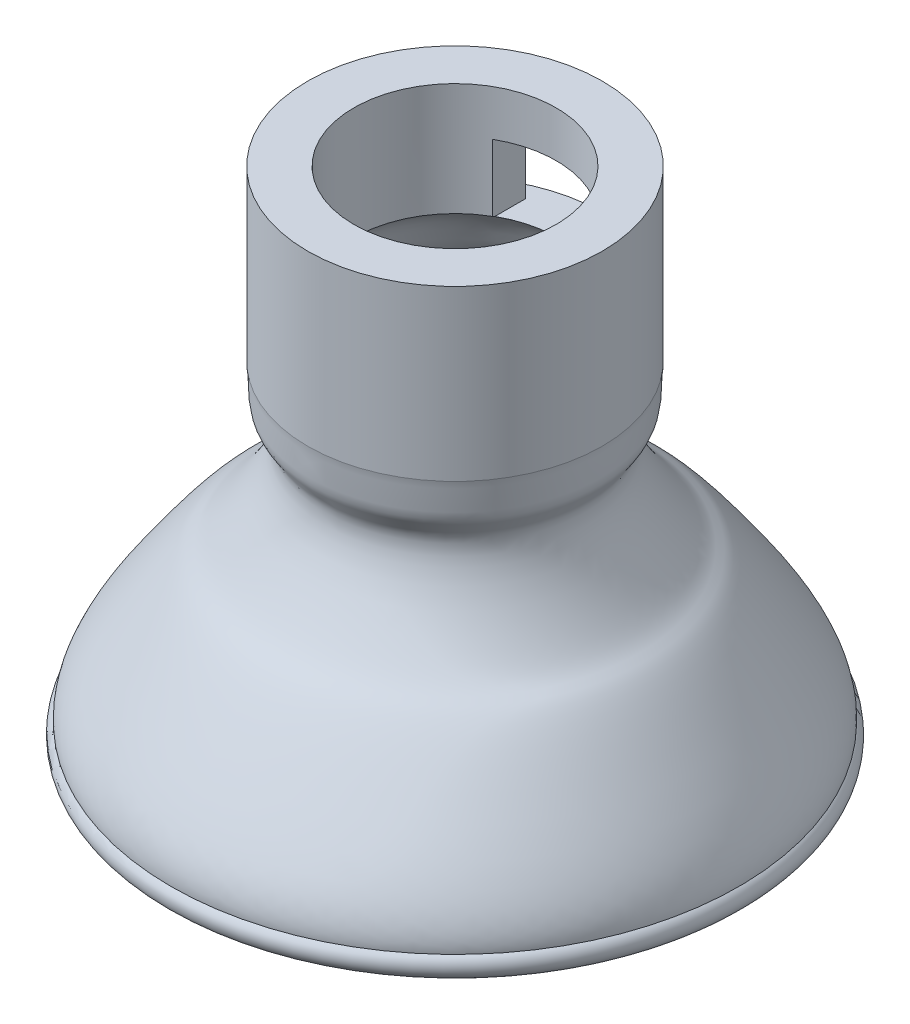
ISO-10303-21;
HEADER;
FILE_DESCRIPTION(('STEP AP214'),'2;1');
FILE_NAME('part.step','',(''),(''),'','','');
FILE_SCHEMA(('AUTOMOTIVE_DESIGN { 1 0 10303 214 1 1 1 1 }'));
ENDSEC;
DATA;
#1=APPLICATION_CONTEXT('core data for automotive mechanical design processes');
#2=APPLICATION_PROTOCOL_DEFINITION('international standard','automotive_design',2000,#1);
#3=PRODUCT_CONTEXT('',#1,'mechanical');
#4=PRODUCT('Part','Part','',(#3));
#5=PRODUCT_RELATED_PRODUCT_CATEGORY('part','',(#4));
#6=PRODUCT_DEFINITION_FORMATION('','',#4);
#7=PRODUCT_DEFINITION_CONTEXT('part definition',#1,'design');
#8=PRODUCT_DEFINITION('design','',#6,#7);
#9=PRODUCT_DEFINITION_SHAPE('','',#8);
#10=(LENGTH_UNIT() NAMED_UNIT(*) SI_UNIT(.MILLI.,.METRE.));
#11=(NAMED_UNIT(*) PLANE_ANGLE_UNIT() SI_UNIT($,.RADIAN.));
#12=(NAMED_UNIT(*) SI_UNIT($,.STERADIAN.) SOLID_ANGLE_UNIT());
#13=UNCERTAINTY_MEASURE_WITH_UNIT(LENGTH_MEASURE(1.E-05),#10,'distance_accuracy_value','');
#14=(GEOMETRIC_REPRESENTATION_CONTEXT(3) GLOBAL_UNCERTAINTY_ASSIGNED_CONTEXT((#13)) GLOBAL_UNIT_ASSIGNED_CONTEXT((#10,
#11,#12)) REPRESENTATION_CONTEXT('',''));
#15=CARTESIAN_POINT('',(0.,0.,0.));
#16=DIRECTION('',(0.,0.,1.));
#17=DIRECTION('',(1.,0.,0.));
#18=AXIS2_PLACEMENT_3D('',#15,#16,#17);
#19=CARTESIAN_POINT('',(0.,44.5173718932186,0.));
#20=DIRECTION('',(0.,1.,0.));
#21=DIRECTION('',(0.,0.,1.));
#22=AXIS2_PLACEMENT_3D('',#19,#20,#21);
#23=CYLINDRICAL_SURFACE('',#22,12.4935963391292);
#24=CARTESIAN_POINT('',(0.,55.7803856774506,0.));
#25=DIRECTION('',(0.,1.,0.));
#26=DIRECTION('',(0.,0.,1.));
#27=AXIS2_PLACEMENT_3D('',#24,#25,#26);
#28=CIRCLE('',#27,12.4935963391292);
#29=CARTESIAN_POINT('',(0.,55.7803856774506,12.4935963391292));
#30=VERTEX_POINT('',#29);
#31=EDGE_CURVE('E203',#30,#30,#28,.T.);
#32=ORIENTED_EDGE('',*,*,#31,.F.);
#33=EDGE_LOOP('',(#32));
#34=FACE_BOUND('',#33,.T.);
#35=CARTESIAN_POINT('',(0.,41.4598835914558,0.));
#36=DIRECTION('',(0.,1.,0.));
#37=DIRECTION('',(0.,0.,1.));
#38=AXIS2_PLACEMENT_3D('',#35,#36,#37);
#39=CIRCLE('',#38,12.4935963391292);
#40=CARTESIAN_POINT('',(0.,41.4598835914558,12.4935963391292));
#41=VERTEX_POINT('',#40);
#42=EDGE_CURVE('E204',#41,#41,#39,.T.);
#43=ORIENTED_EDGE('',*,*,#42,.T.);
#44=EDGE_LOOP('',(#43));
#45=FACE_BOUND('',#44,.T.);
#46=DIRECTION('',(0.,1.,0.));
#47=VECTOR('',#46,1.);
#48=CARTESIAN_POINT('',(7.14365701002743,44.5173718932186,-10.2497860469469));
#49=LINE('',#48,#47);
#50=CARTESIAN_POINT('',(7.14365701002743,51.8993350708418,-10.2497860469469));
#51=VERTEX_POINT('',#50);
#52=CARTESIAN_POINT('',(7.14365701002743,46.1352918868515,-10.2497860469469));
#53=VERTEX_POINT('',#52);
#54=EDGE_CURVE('E94',#51,#53,#49,.F.);
#55=ORIENTED_EDGE('',*,*,#54,.F.);
#56=CARTESIAN_POINT('',(0.,51.8993350708418,0.));
#57=DIRECTION('',(0.,1.,0.));
#58=DIRECTION('',(0.,0.,1.));
#59=AXIS2_PLACEMENT_3D('',#56,#57,#58);
#60=CIRCLE('',#59,12.4935963391292);
#61=CARTESIAN_POINT('',(-7.14365701002743,51.8993350708418,-10.2497860469469));
#62=VERTEX_POINT('',#61);
#63=EDGE_CURVE('E131',#51,#62,#60,.T.);
#64=ORIENTED_EDGE('',*,*,#63,.T.);
#65=DIRECTION('',(0.,1.,0.));
#66=VECTOR('',#65,1.);
#67=CARTESIAN_POINT('',(-7.14365701002743,44.5173718932186,-10.2497860469469));
#68=LINE('',#67,#66);
#69=CARTESIAN_POINT('',(-7.14365701002743,46.1352918868515,-10.2497860469469));
#70=VERTEX_POINT('',#69);
#71=EDGE_CURVE('E96',#70,#62,#68,.T.);
#72=ORIENTED_EDGE('',*,*,#71,.F.);
#73=CARTESIAN_POINT('',(0.,46.1352918868515,0.));
#74=DIRECTION('',(0.,-1.,0.));
#75=DIRECTION('',(0.,0.,-1.));
#76=AXIS2_PLACEMENT_3D('',#73,#74,#75);
#77=CIRCLE('',#76,12.4935963391292);
#78=EDGE_CURVE('E42',#70,#53,#77,.T.);
#79=ORIENTED_EDGE('',*,*,#78,.T.);
#80=EDGE_LOOP('',(#55,#64,#72,#79));
#81=FACE_BOUND('',#80,.T.);
#82=ADVANCED_FACE('F32',(#34,#45,#81),#23,.T.);
#83=CARTESIAN_POINT('',(-4.26037974468844,46.1352918868515,-21.));
#84=DIRECTION('',(-1.,0.,0.));
#85=DIRECTION('',(0.,0.,1.));
#86=AXIS2_PLACEMENT_3D('',#83,#84,#85);
#87=PLANE('',#86);
#88=DIRECTION('',(0.,-1.,0.));
#89=VECTOR('',#88,1.);
#90=CARTESIAN_POINT('',(-4.26037974468844,46.1352918868515,-10.2497860469469));
#91=LINE('',#90,#89);
#92=CARTESIAN_POINT('',(-4.26037974468844,51.8993350708418,-10.2497860469469));
#93=VERTEX_POINT('',#92);
#94=CARTESIAN_POINT('',(-4.26037974468844,46.1352918868515,-10.2497860469469));
#95=VERTEX_POINT('',#94);
#96=EDGE_CURVE('E106',#93,#95,#91,.T.);
#97=ORIENTED_EDGE('',*,*,#96,.F.);
#98=DIRECTION('',(0.,0.,1.));
#99=VECTOR('',#98,1.);
#100=CARTESIAN_POINT('',(-4.26037974468844,51.8993350708418,-21.));
#101=LINE('',#100,#99);
#102=CARTESIAN_POINT('',(-4.26037974468844,51.8993350708418,-7.44282760856129));
#103=VERTEX_POINT('',#102);
#104=EDGE_CURVE('E120',#93,#103,#101,.T.);
#105=ORIENTED_EDGE('',*,*,#104,.T.);
#106=DIRECTION('',(0.,1.,0.));
#107=VECTOR('',#106,1.);
#108=CARTESIAN_POINT('',(-4.26037974468844,44.5173718932186,-7.44282760856129));
#109=LINE('',#108,#107);
#110=CARTESIAN_POINT('',(-4.26037974468844,46.2369670314063,-7.44282760856129));
#111=VERTEX_POINT('',#110);
#112=EDGE_CURVE('E98',#111,#103,#109,.T.);
#113=ORIENTED_EDGE('',*,*,#112,.F.);
#114=CARTESIAN_POINT('',(-4.26037974468844,46.1352918868515,-7.64548123228192));
#115=CARTESIAN_POINT('',(-4.26037974468844,46.1532267587351,-7.61220183553225));
#116=CARTESIAN_POINT('',(-4.26037974468844,46.1706671233898,-7.5786743351807));
#117=CARTESIAN_POINT('',(-4.26037974468844,46.2045588382414,-7.51112312727382));
#118=CARTESIAN_POINT('',(-4.26037974468844,46.2210101884383,-7.4770994197185));
#119=CARTESIAN_POINT('',(-4.26037974468844,46.2369670314063,-7.44282760856129));
#120=B_SPLINE_CURVE_WITH_KNOTS('',3,(#114,#115,#116,#117,#118,#119),.UNSPECIFIED.,.F.,.F.,(4,2,
4),(0.,0.113376965879346,0.226753931758696),.UNSPECIFIED.);
#121=CARTESIAN_POINT('',(-4.26037974468844,46.1352918868516,-7.64548123228194));
#122=VERTEX_POINT('',#121);
#123=EDGE_CURVE('E149',#122,#111,#120,.T.);
#124=ORIENTED_EDGE('',*,*,#123,.F.);
#125=DIRECTION('',(0.,0.,1.));
#126=VECTOR('',#125,1.);
#127=CARTESIAN_POINT('',(-4.26037974468844,46.1352918868515,-21.));
#128=LINE('',#127,#126);
#129=EDGE_CURVE('E119',#95,#122,#128,.T.);
#130=ORIENTED_EDGE('',*,*,#129,.F.);
#131=EDGE_LOOP('',(#97,#105,#113,#124,#130));
#132=FACE_BOUND('',#131,.T.);
#133=ADVANCED_FACE('F138',(#132),#87,.F.);
#134=CARTESIAN_POINT('',(4.26037974468844,46.1352918868515,-21.));
#135=DIRECTION('',(1.,0.,0.));
#136=DIRECTION('',(0.,0.,-1.));
#137=AXIS2_PLACEMENT_3D('',#134,#135,#136);
#138=PLANE('',#137);
#139=DIRECTION('',(0.,1.,0.));
#140=VECTOR('',#139,1.);
#141=CARTESIAN_POINT('',(4.26037974468844,46.1352918868515,-10.2497860469469));
#142=LINE('',#141,#140);
#143=CARTESIAN_POINT('',(4.26037974468844,46.1352918868515,-10.2497860469469));
#144=VERTEX_POINT('',#143);
#145=CARTESIAN_POINT('',(4.26037974468844,51.8993350708418,-10.2497860469469));
#146=VERTEX_POINT('',#145);
#147=EDGE_CURVE('E11',#144,#146,#142,.T.);
#148=ORIENTED_EDGE('',*,*,#147,.F.);
#149=DIRECTION('',(0.,0.,1.));
#150=VECTOR('',#149,1.);
#151=CARTESIAN_POINT('',(4.26037974468844,46.1352918868515,-21.));
#152=LINE('',#151,#150);
#153=CARTESIAN_POINT('',(4.26037974468844,46.1352918868516,-7.64548123228194));
#154=VERTEX_POINT('',#153);
#155=EDGE_CURVE('E111',#144,#154,#152,.T.);
#156=ORIENTED_EDGE('',*,*,#155,.T.);
#157=CARTESIAN_POINT('',(4.26037974468844,46.2369670314063,-7.44282760856129));
#158=CARTESIAN_POINT('',(4.26037974468844,46.2210101884382,-7.47709941971862));
#159=CARTESIAN_POINT('',(4.26037974468844,46.2045588382413,-7.51112312727406));
#160=CARTESIAN_POINT('',(4.26037974468844,46.1706671233895,-7.57867433518117));
#161=CARTESIAN_POINT('',(4.26037974468844,46.1532267587348,-7.61220183553284));
#162=CARTESIAN_POINT('',(4.26037974468844,46.1352918868512,-7.64548123228262));
#163=B_SPLINE_CURVE_WITH_KNOTS('',3,(#157,#158,#159,#160,#161,#162),.UNSPECIFIED.,.F.,.F.,(4,2,
4),(0.,0.113376965879743,0.226753931759487),.UNSPECIFIED.);
#164=CARTESIAN_POINT('',(4.26037974468844,46.2369670314063,-7.44282760856129));
#165=VERTEX_POINT('',#164);
#166=EDGE_CURVE('E57',#165,#154,#163,.T.);
#167=ORIENTED_EDGE('',*,*,#166,.F.);
#168=DIRECTION('',(0.,1.,0.));
#169=VECTOR('',#168,1.);
#170=CARTESIAN_POINT('',(4.26037974468844,44.5173718932186,-7.44282760856129));
#171=LINE('',#170,#169);
#172=CARTESIAN_POINT('',(4.26037974468844,51.8993350708418,-7.44282760856129));
#173=VERTEX_POINT('',#172);
#174=EDGE_CURVE('E219',#173,#165,#171,.F.);
#175=ORIENTED_EDGE('',*,*,#174,.F.);
#176=DIRECTION('',(0.,0.,1.));
#177=VECTOR('',#176,1.);
#178=CARTESIAN_POINT('',(4.26037974468844,51.8993350708418,-21.));
#179=LINE('',#178,#177);
#180=EDGE_CURVE('E122',#146,#173,#179,.T.);
#181=ORIENTED_EDGE('',*,*,#180,.F.);
#182=EDGE_LOOP('',(#148,#156,#167,#175,#181));
#183=FACE_BOUND('',#182,.T.);
#184=ADVANCED_FACE('F133',(#183),#138,.F.);
#185=CARTESIAN_POINT('',(8.5759266776083,46.2369670314063,0.));
#186=CARTESIAN_POINT('',(10.332192588142,45.2940319100021,0.));
#187=CARTESIAN_POINT('',(10.4933290377803,43.239681156603,0.));
#188=CARTESIAN_POINT('',(11.3073060680917,41.6407575609535,0.));
#189=B_SPLINE_CURVE_WITH_KNOTS('',3,(#185,#186,#187,#188),.UNSPECIFIED.,.F.,.F.,(4,4),(0.,1.),.UNSPECIFIED.);
#190=CARTESIAN_POINT('',(0.,44.5173718932186,0.));
#191=DIRECTION('',(0.,1.,0.));
#192=AXIS1_PLACEMENT('',#190,#191);
#193=SURFACE_OF_REVOLUTION('',#189,#192);
#194=CARTESIAN_POINT('',(0.,41.6407575609535,0.));
#195=DIRECTION('',(0.,1.,0.));
#196=DIRECTION('',(0.,0.,1.));
#197=AXIS2_PLACEMENT_3D('',#194,#195,#196);
#198=CIRCLE('',#197,11.3073060680917);
#199=CARTESIAN_POINT('',(0.,41.6407575609535,11.3073060680917));
#200=VERTEX_POINT('',#199);
#201=EDGE_CURVE('E216',#200,#200,#198,.T.);
#202=ORIENTED_EDGE('',*,*,#201,.F.);
#203=EDGE_LOOP('',(#202));
#204=FACE_BOUND('',#203,.T.);
#205=CARTESIAN_POINT('',(0.,46.1352918868516,0.));
#206=DIRECTION('',(0.,1.,0.));
#207=DIRECTION('',(0.,0.,1.));
#208=AXIS2_PLACEMENT_3D('',#205,#206,#207);
#209=CIRCLE('',#208,8.75238360917338);
#210=EDGE_CURVE('E155',#154,#122,#209,.T.);
#211=ORIENTED_EDGE('',*,*,#210,.T.);
#212=ORIENTED_EDGE('',*,*,#123,.T.);
#213=CARTESIAN_POINT('',(0.,46.2369670314063,0.));
#214=DIRECTION('',(0.,1.,0.));
#215=DIRECTION('',(0.,0.,1.));
#216=AXIS2_PLACEMENT_3D('',#213,#214,#215);
#217=CIRCLE('',#216,8.5759266776083);
#218=EDGE_CURVE('E157',#111,#165,#217,.T.);
#219=ORIENTED_EDGE('',*,*,#218,.T.);
#220=ORIENTED_EDGE('',*,*,#166,.T.);
#221=EDGE_LOOP('',(#211,#212,#219,#220));
#222=FACE_BOUND('',#221,.T.);
#223=ADVANCED_FACE('F34',(#204,#222),#193,.T.);
#224=CARTESIAN_POINT('',(11.3073060680917,41.6407575609535,0.));
#225=CARTESIAN_POINT('',(11.273508041599,41.4190879082118,0.));
#226=CARTESIAN_POINT('',(11.2251015035486,40.9573761069875,0.));
#227=CARTESIAN_POINT('',(11.1930262788754,40.1522096645191,0.));
#228=CARTESIAN_POINT('',(11.1940251636809,39.3040884747996,0.));
#229=CARTESIAN_POINT('',(11.1105742964061,38.7770787074592,0.));
#230=CARTESIAN_POINT('',(11.0298099911624,38.5851130778379,0.));
#231=CARTESIAN_POINT('',(10.8756263455903,38.3306613844222,0.));
#232=CARTESIAN_POINT('',(10.6327827141087,37.9932061061229,0.));
#233=CARTESIAN_POINT('',(10.3378807728369,37.5542407148791,0.));
#234=CARTESIAN_POINT('',(10.0435892672873,36.9656870997583,0.));
#235=CARTESIAN_POINT('',(9.82602737150881,36.0076366987024,0.));
#236=CARTESIAN_POINT('',(9.9145565741438,34.8903359516371,0.));
#237=CARTESIAN_POINT('',(10.2964891531475,33.5752929992727,0.));
#238=CARTESIAN_POINT('',(10.8638919097121,32.2936180990521,0.));
#239=CARTESIAN_POINT('',(11.7590713878996,30.6644683747912,0.));
#240=CARTESIAN_POINT('',(12.9463673409138,28.9199205511686,0.));
#241=CARTESIAN_POINT('',(13.9488027624371,27.6965326702799,0.));
#242=CARTESIAN_POINT('',(14.8014094043892,26.960382806733,0.));
#243=CARTESIAN_POINT('',(15.4186672927998,26.5770592305342,0.));
#244=CARTESIAN_POINT('',(15.8418449649625,26.2557480792935,0.));
#245=CARTESIAN_POINT('',(16.5895523927449,25.4893297297657,0.));
#246=CARTESIAN_POINT('',(17.6296319300326,24.2205109793635,0.));
#247=CARTESIAN_POINT('',(19.0007275572404,22.3695444808766,0.));
#248=CARTESIAN_POINT('',(20.5443708517538,20.2007844705444,0.));
#249=CARTESIAN_POINT('',(21.7129288063574,18.3358963729081,0.));
#250=CARTESIAN_POINT('',(22.30297555417,17.206719636529,0.));
#251=CARTESIAN_POINT('',(22.6378524988566,16.3822789589346,0.));
#252=CARTESIAN_POINT('',(22.8087304327176,15.8291983435413,0.));
#253=CARTESIAN_POINT('',(22.8907692851184,15.3467573554972,0.));
#254=CARTESIAN_POINT('',(22.8942843663275,15.1404230191427,0.));
#255=CARTESIAN_POINT('',(22.8835923643521,15.0235539243176,0.));
#256=B_SPLINE_CURVE_WITH_KNOTS('',3,(#224,#225,#226,#227,#228,#229,#230,#231,#232,#233,#234,
#235,#236,#237,#238,#239,#240,#241,#242,#243,#244,#245,#246,#247,#248,#249,#250,#251,#252,#253,
#254,#255),.UNSPECIFIED.,.F.,.F.,(4,1,1,1,1,1,1,1,1,1,1,1,1,1,1,1,1,1,1,1,1,1,1,1,1,1,1,1,1,4),
(0.,0.015625,0.03125,0.0625,0.09375,0.109375,0.125,0.140625,0.15625,0.171875,0.1875,0.21875,
0.25,0.28125,0.3125,0.375,0.4375,0.5,0.5625,0.625,0.6875,0.75,0.8125,0.875,0.90625,0.9375,
0.953125,0.96875,0.984375,1.),.UNSPECIFIED.);
#257=CARTESIAN_POINT('',(0.,44.5173718932186,0.));
#258=DIRECTION('',(0.,1.,0.));
#259=AXIS1_PLACEMENT('',#257,#258);
#260=SURFACE_OF_REVOLUTION('',#256,#259);
#261=CARTESIAN_POINT('',(0.,15.0235539243176,0.));
#262=DIRECTION('',(0.,1.,0.));
#263=DIRECTION('',(0.,0.,1.));
#264=AXIS2_PLACEMENT_3D('',#261,#262,#263);
#265=CIRCLE('',#264,22.8835923643521);
#266=CARTESIAN_POINT('',(0.,15.0235539243176,22.8835923643521));
#267=VERTEX_POINT('',#266);
#268=EDGE_CURVE('E213',#267,#267,#265,.T.);
#269=ORIENTED_EDGE('',*,*,#268,.F.);
#270=EDGE_LOOP('',(#269));
#271=FACE_BOUND('',#270,.T.);
#272=ORIENTED_EDGE('',*,*,#201,.T.);
#273=EDGE_LOOP('',(#272));
#274=FACE_BOUND('',#273,.T.);
#275=ADVANCED_FACE('F176',(#271,#274),#260,.T.);
#276=CARTESIAN_POINT('',(0.,14.0472447319222,0.));
#277=DIRECTION('',(0.,1.,0.));
#278=DIRECTION('',(0.,0.,1.));
#279=AXIS2_PLACEMENT_3D('',#276,#277,#278);
#280=TOROIDAL_SURFACE('',#279,23.3967785015059,1.10296856279885);
#281=CARTESIAN_POINT('',(0.,14.9142261099905,0.));
#282=DIRECTION('',(0.,1.,0.));
#283=DIRECTION('',(0.,0.,1.));
#284=AXIS2_PLACEMENT_3D('',#281,#282,#283);
#285=CIRCLE('',#284,24.0786017488401);
#286=CARTESIAN_POINT('',(0.,14.9142261099905,24.0786017488401));
#287=VERTEX_POINT('',#286);
#288=EDGE_CURVE('E207',#287,#287,#285,.T.);
#289=ORIENTED_EDGE('',*,*,#288,.F.);
#290=EDGE_LOOP('',(#289));
#291=FACE_BOUND('',#290,.T.);
#292=ORIENTED_EDGE('',*,*,#268,.T.);
#293=EDGE_LOOP('',(#292));
#294=FACE_BOUND('',#293,.T.);
#295=ADVANCED_FACE('F179',(#291,#294),#280,.T.);
#296=CARTESIAN_POINT('',(24.0786017488401,14.9142261099905,0.));
#297=CARTESIAN_POINT('',(24.2565774191024,16.8595919574938,0.));
#298=CARTESIAN_POINT('',(19.3541824007571,24.1429814177966,0.));
#299=CARTESIAN_POINT('',(16.0898593776845,28.0208324759485,0.));
#300=CARTESIAN_POINT('',(14.8594976282133,27.8083674685372,0.));
#301=CARTESIAN_POINT('',(9.89822685484025,35.8696378728624,0.));
#302=CARTESIAN_POINT('',(12.6726760283346,38.2323070853864,0.));
#303=CARTESIAN_POINT('',(12.3012634032978,40.1984378941539,0.));
#304=CARTESIAN_POINT('',(12.4935963391292,41.4598835914558,0.));
#305=B_SPLINE_CURVE_WITH_KNOTS('',3,(#296,#297,#298,#299,#300,#301,#302,#303,#304),
.UNSPECIFIED.,.F.,.F.,(4,1,1,1,1,1,4),(0.,0.16403790876829,0.396707876856077,0.62712491194168,
0.824960166484308,0.898995296980307,1.),.UNSPECIFIED.);
#306=CARTESIAN_POINT('',(0.,44.5173718932186,0.));
#307=DIRECTION('',(0.,1.,0.));
#308=AXIS1_PLACEMENT('',#306,#307);
#309=SURFACE_OF_REVOLUTION('',#305,#308);
#310=ORIENTED_EDGE('',*,*,#42,.F.);
#311=EDGE_LOOP('',(#310));
#312=FACE_BOUND('',#311,.T.);
#313=ORIENTED_EDGE('',*,*,#288,.T.);
#314=EDGE_LOOP('',(#313));
#315=FACE_BOUND('',#314,.T.);
#316=ADVANCED_FACE('F183',(#312,#315),#309,.T.);
#317=CARTESIAN_POINT('',(8.5759266776083,55.7803856774506,0.));
#318=DIRECTION('',(0.,-1.,0.));
#319=DIRECTION('',(0.,0.,-1.));
#320=AXIS2_PLACEMENT_3D('',#317,#318,#319);
#321=PLANE('',#320);
#322=CARTESIAN_POINT('',(0.,55.7803856774506,0.));
#323=DIRECTION('',(0.,1.,0.));
#324=DIRECTION('',(0.,0.,1.));
#325=AXIS2_PLACEMENT_3D('',#322,#323,#324);
#326=CIRCLE('',#325,8.5759266776083);
#327=CARTESIAN_POINT('',(0.,55.7803856774506,8.5759266776083));
#328=VERTEX_POINT('',#327);
#329=EDGE_CURVE('E200',#328,#328,#326,.T.);
#330=ORIENTED_EDGE('',*,*,#329,.F.);
#331=EDGE_LOOP('',(#330));
#332=FACE_BOUND('',#331,.T.);
#333=ORIENTED_EDGE('',*,*,#31,.T.);
#334=EDGE_LOOP('',(#333));
#335=FACE_BOUND('',#334,.T.);
#336=ADVANCED_FACE('F187',(#332,#335),#321,.F.);
#337=CARTESIAN_POINT('',(0.,44.5173718932186,0.));
#338=DIRECTION('',(0.,1.,0.));
#339=DIRECTION('',(0.,0.,1.));
#340=AXIS2_PLACEMENT_3D('',#337,#338,#339);
#341=CYLINDRICAL_SURFACE('',#340,8.5759266776083);
#342=ORIENTED_EDGE('',*,*,#218,.F.);
#343=ORIENTED_EDGE('',*,*,#112,.T.);
#344=CARTESIAN_POINT('',(0.,51.8993350708418,0.));
#345=DIRECTION('',(0.,1.,0.));
#346=DIRECTION('',(0.,0.,1.));
#347=AXIS2_PLACEMENT_3D('',#344,#345,#346);
#348=CIRCLE('',#347,8.5759266776083);
#349=EDGE_CURVE('E221',#103,#173,#348,.F.);
#350=ORIENTED_EDGE('',*,*,#349,.T.);
#351=ORIENTED_EDGE('',*,*,#174,.T.);
#352=EDGE_LOOP('',(#342,#343,#350,#351));
#353=FACE_BOUND('',#352,.T.);
#354=ORIENTED_EDGE('',*,*,#329,.T.);
#355=EDGE_LOOP('',(#354));
#356=FACE_BOUND('',#355,.T.);
#357=ADVANCED_FACE('F143',(#353,#356),#341,.F.);
#358=CARTESIAN_POINT('',(4.26037974468844,46.1352918868515,-21.));
#359=DIRECTION('',(0.,-1.,0.));
#360=DIRECTION('',(0.,0.,-1.));
#361=AXIS2_PLACEMENT_3D('',#358,#359,#360);
#362=PLANE('',#361);
#363=ORIENTED_EDGE('',*,*,#78,.F.);
#364=DIRECTION('',(-1.,0.,0.));
#365=VECTOR('',#364,1.);
#366=CARTESIAN_POINT('',(21.,46.1352918868515,-10.2497860469469));
#367=LINE('',#366,#365);
#368=EDGE_CURVE('E49',#95,#70,#367,.T.);
#369=ORIENTED_EDGE('',*,*,#368,.F.);
#370=ORIENTED_EDGE('',*,*,#129,.T.);
#371=ORIENTED_EDGE('',*,*,#210,.F.);
#372=ORIENTED_EDGE('',*,*,#155,.F.);
#373=EDGE_CURVE('E102',#53,#144,#367,.T.);
#374=ORIENTED_EDGE('',*,*,#373,.F.);
#375=EDGE_LOOP('',(#363,#369,#370,#371,#372,#374));
#376=FACE_BOUND('',#375,.T.);
#377=ADVANCED_FACE('F109',(#376),#362,.F.);
#378=CARTESIAN_POINT('',(4.26037974468844,51.8993350708418,-21.));
#379=DIRECTION('',(0.,1.,0.));
#380=DIRECTION('',(0.,0.,1.));
#381=AXIS2_PLACEMENT_3D('',#378,#379,#380);
#382=PLANE('',#381);
#383=ORIENTED_EDGE('',*,*,#63,.F.);
#384=DIRECTION('',(-1.,0.,0.));
#385=VECTOR('',#384,1.);
#386=CARTESIAN_POINT('',(21.,51.8993350708418,-10.2497860469469));
#387=LINE('',#386,#385);
#388=EDGE_CURVE('E105',#51,#146,#387,.T.);
#389=ORIENTED_EDGE('',*,*,#388,.T.);
#390=ORIENTED_EDGE('',*,*,#180,.T.);
#391=ORIENTED_EDGE('',*,*,#349,.F.);
#392=ORIENTED_EDGE('',*,*,#104,.F.);
#393=EDGE_CURVE('E112',#93,#62,#387,.T.);
#394=ORIENTED_EDGE('',*,*,#393,.T.);
#395=EDGE_LOOP('',(#383,#389,#390,#391,#392,#394));
#396=FACE_BOUND('',#395,.T.);
#397=ADVANCED_FACE('F139',(#396),#382,.F.);
#398=CARTESIAN_POINT('',(21.,51.8993350708418,-10.2497860469469));
#399=DIRECTION('',(0.,0.,-1.));
#400=DIRECTION('',(-1.,0.,0.));
#401=AXIS2_PLACEMENT_3D('',#398,#399,#400);
#402=PLANE('',#401);
#403=ORIENTED_EDGE('',*,*,#54,.T.);
#404=ORIENTED_EDGE('',*,*,#373,.T.);
#405=ORIENTED_EDGE('',*,*,#147,.T.);
#406=ORIENTED_EDGE('',*,*,#388,.F.);
#407=EDGE_LOOP('',(#403,#404,#405,#406));
#408=FACE_BOUND('',#407,.T.);
#409=ADVANCED_FACE('F101',(#408),#402,.T.);
#410=ORIENTED_EDGE('',*,*,#71,.T.);
#411=ORIENTED_EDGE('',*,*,#393,.F.);
#412=ORIENTED_EDGE('',*,*,#96,.T.);
#413=ORIENTED_EDGE('',*,*,#368,.T.);
#414=EDGE_LOOP('',(#410,#411,#412,#413));
#415=FACE_BOUND('',#414,.T.);
#416=ADVANCED_FACE('F237',(#415),#402,.T.);
#417=CLOSED_SHELL('',(#82,#133,#184,#223,#275,#295,#316,#336,#357,#377,#397,#409,#416));
#418=MANIFOLD_SOLID_BREP('B2',#417);
#419=ADVANCED_BREP_SHAPE_REPRESENTATION('',(#18,#418),#14);
#420=SHAPE_DEFINITION_REPRESENTATION(#9,#419);
ENDSEC;
END-ISO-10303-21;
